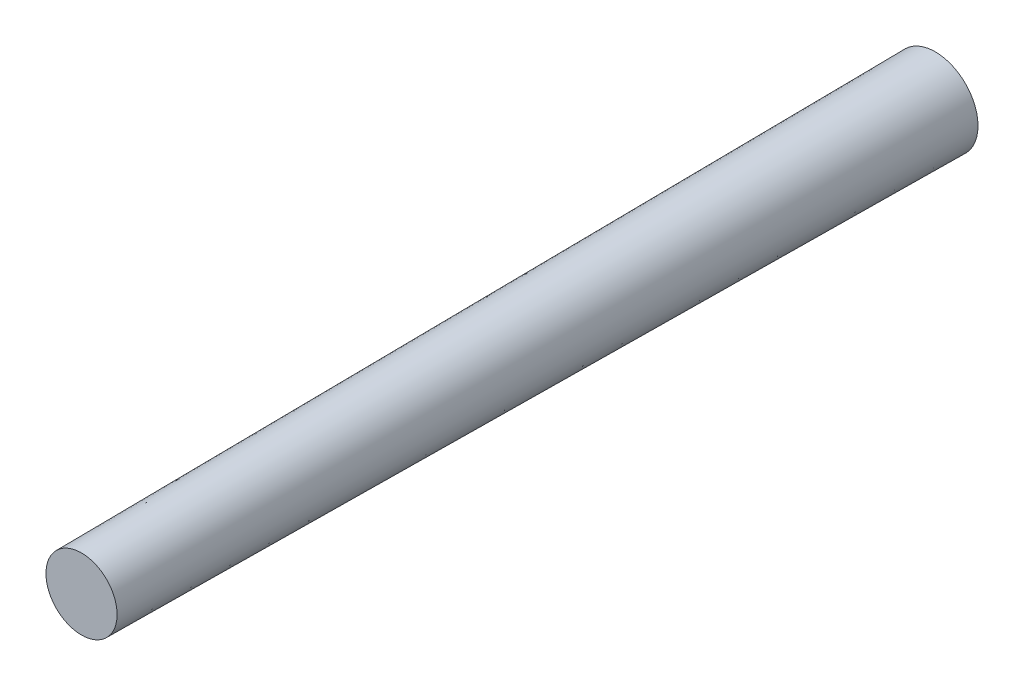
ISO-10303-21;
HEADER;
FILE_DESCRIPTION(('STEP AP214'),'2;1');
FILE_NAME('part.step','',(''),(''),'','','');
FILE_SCHEMA(('AUTOMOTIVE_DESIGN { 1 0 10303 214 1 1 1 1 }'));
ENDSEC;
DATA;
#1=APPLICATION_CONTEXT('core data for automotive mechanical design processes');
#2=APPLICATION_PROTOCOL_DEFINITION('international standard','automotive_design',2000,#1);
#3=PRODUCT_CONTEXT('',#1,'mechanical');
#4=PRODUCT('Part','Part','',(#3));
#5=PRODUCT_RELATED_PRODUCT_CATEGORY('part','',(#4));
#6=PRODUCT_DEFINITION_FORMATION('','',#4);
#7=PRODUCT_DEFINITION_CONTEXT('part definition',#1,'design');
#8=PRODUCT_DEFINITION('design','',#6,#7);
#9=PRODUCT_DEFINITION_SHAPE('','',#8);
#10=(LENGTH_UNIT() NAMED_UNIT(*) SI_UNIT(.MILLI.,.METRE.));
#11=(NAMED_UNIT(*) PLANE_ANGLE_UNIT() SI_UNIT($,.RADIAN.));
#12=(NAMED_UNIT(*) SI_UNIT($,.STERADIAN.) SOLID_ANGLE_UNIT());
#13=UNCERTAINTY_MEASURE_WITH_UNIT(LENGTH_MEASURE(1.E-05),#10,'distance_accuracy_value','');
#14=(GEOMETRIC_REPRESENTATION_CONTEXT(3) GLOBAL_UNCERTAINTY_ASSIGNED_CONTEXT((#13)) GLOBAL_UNIT_ASSIGNED_CONTEXT((#10,
#11,#12)) REPRESENTATION_CONTEXT('',''));
#15=CARTESIAN_POINT('',(0.,0.,0.));
#16=DIRECTION('',(0.,0.,1.));
#17=DIRECTION('',(1.,0.,0.));
#18=AXIS2_PLACEMENT_3D('',#15,#16,#17);
#19=CARTESIAN_POINT('',(0.,0.,0.));
#20=DIRECTION('',(0.,0.,-1.));
#21=DIRECTION('',(1.,0.,0.));
#22=AXIS2_PLACEMENT_3D('',#19,#20,#21);
#23=CONICAL_SURFACE('',#22,3.,0.00832522053201297);
#24=CARTESIAN_POINT('',(0.,0.,60.));
#25=DIRECTION('',(0.,0.,1.));
#26=DIRECTION('',(1.,0.,0.));
#27=AXIS2_PLACEMENT_3D('',#24,#25,#26);
#28=CIRCLE('',#27,2.50047522745564);
#29=CARTESIAN_POINT('',(2.50047522745564,0.,60.));
#30=VERTEX_POINT('',#29);
#31=EDGE_CURVE('E10',#30,#30,#28,.T.);
#32=ORIENTED_EDGE('',*,*,#31,.F.);
#33=EDGE_LOOP('',(#32));
#34=FACE_BOUND('',#33,.T.);
#35=CARTESIAN_POINT('',(0.,0.,0.));
#36=DIRECTION('',(0.,0.,1.));
#37=DIRECTION('',(1.,0.,0.));
#38=AXIS2_PLACEMENT_3D('',#35,#36,#37);
#39=CIRCLE('',#38,3.);
#40=CARTESIAN_POINT('',(3.,0.,0.));
#41=VERTEX_POINT('',#40);
#42=EDGE_CURVE('E44',#41,#41,#39,.T.);
#43=ORIENTED_EDGE('',*,*,#42,.T.);
#44=EDGE_LOOP('',(#43));
#45=FACE_BOUND('',#44,.T.);
#46=ADVANCED_FACE('F37',(#34,#45),#23,.T.);
#47=CARTESIAN_POINT('',(0.,0.,60.));
#48=DIRECTION('',(0.,0.,1.));
#49=DIRECTION('',(1.,0.,0.));
#50=AXIS2_PLACEMENT_3D('',#47,#48,#49);
#51=PLANE('',#50);
#52=ORIENTED_EDGE('',*,*,#31,.T.);
#53=EDGE_LOOP('',(#52));
#54=FACE_BOUND('',#53,.T.);
#55=ADVANCED_FACE('F54',(#54),#51,.T.);
#56=CARTESIAN_POINT('',(0.,0.,0.));
#57=DIRECTION('',(0.,0.,1.));
#58=DIRECTION('',(1.,0.,0.));
#59=AXIS2_PLACEMENT_3D('',#56,#57,#58);
#60=PLANE('',#59);
#61=ORIENTED_EDGE('',*,*,#42,.F.);
#62=EDGE_LOOP('',(#61));
#63=FACE_BOUND('',#62,.T.);
#64=ADVANCED_FACE('F52',(#63),#60,.F.);
#65=CLOSED_SHELL('',(#46,#55,#64));
#66=MANIFOLD_SOLID_BREP('B2',#65);
#67=ADVANCED_BREP_SHAPE_REPRESENTATION('',(#18,#66),#14);
#68=SHAPE_DEFINITION_REPRESENTATION(#9,#67);
ENDSEC;
END-ISO-10303-21;
